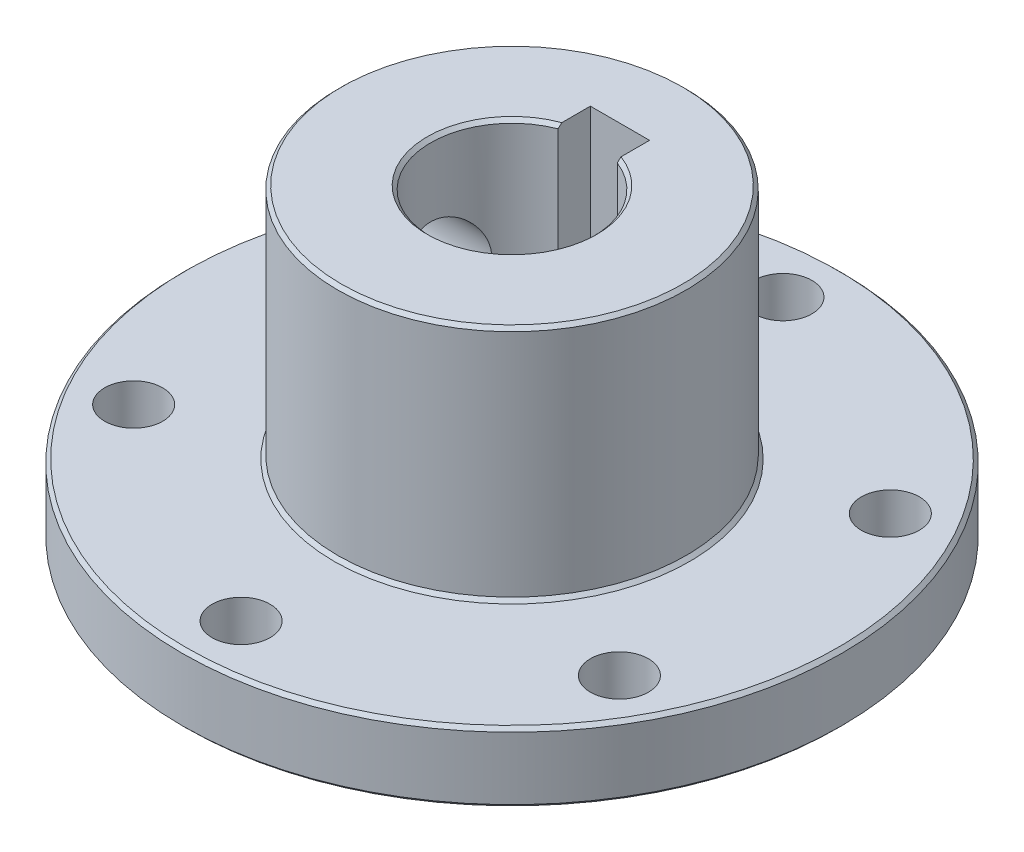
ISO-10303-21;
HEADER;
FILE_DESCRIPTION(('STEP AP214'),'2;1');
FILE_NAME('part.step','',(''),(''),'','','');
FILE_SCHEMA(('AUTOMOTIVE_DESIGN { 1 0 10303 214 1 1 1 1 }'));
ENDSEC;
DATA;
#1=APPLICATION_CONTEXT('core data for automotive mechanical design processes');
#2=APPLICATION_PROTOCOL_DEFINITION('international standard','automotive_design',2000,#1);
#3=PRODUCT_CONTEXT('',#1,'mechanical');
#4=PRODUCT('Part','Part','',(#3));
#5=PRODUCT_RELATED_PRODUCT_CATEGORY('part','',(#4));
#6=PRODUCT_DEFINITION_FORMATION('','',#4);
#7=PRODUCT_DEFINITION_CONTEXT('part definition',#1,'design');
#8=PRODUCT_DEFINITION('design','',#6,#7);
#9=PRODUCT_DEFINITION_SHAPE('','',#8);
#10=(LENGTH_UNIT() NAMED_UNIT(*) SI_UNIT(.MILLI.,.METRE.));
#11=(NAMED_UNIT(*) PLANE_ANGLE_UNIT() SI_UNIT($,.RADIAN.));
#12=(NAMED_UNIT(*) SI_UNIT($,.STERADIAN.) SOLID_ANGLE_UNIT());
#13=UNCERTAINTY_MEASURE_WITH_UNIT(LENGTH_MEASURE(1.E-05),#10,'distance_accuracy_value','');
#14=(GEOMETRIC_REPRESENTATION_CONTEXT(3) GLOBAL_UNCERTAINTY_ASSIGNED_CONTEXT((#13)) GLOBAL_UNIT_ASSIGNED_CONTEXT((#10,
#11,#12)) REPRESENTATION_CONTEXT('',''));
#15=CARTESIAN_POINT('',(0.,0.,0.));
#16=DIRECTION('',(0.,0.,1.));
#17=DIRECTION('',(1.,0.,0.));
#18=AXIS2_PLACEMENT_3D('',#15,#16,#17);
#19=CARTESIAN_POINT('',(0.,26.4,0.));
#20=DIRECTION('',(0.,1.,0.));
#21=DIRECTION('',(0.,0.,1.));
#22=AXIS2_PLACEMENT_3D('',#19,#20,#21);
#23=PLANE('',#22);
#24=CARTESIAN_POINT('',(0.,26.4,0.));
#25=DIRECTION('',(0.,1.,0.));
#26=DIRECTION('',(0.,0.,1.));
#27=AXIS2_PLACEMENT_3D('',#24,#25,#26);
#28=CIRCLE('',#27,14.7);
#29=CARTESIAN_POINT('',(0.,26.4,14.7));
#30=VERTEX_POINT('',#29);
#31=EDGE_CURVE('E244',#30,#30,#28,.T.);
#32=ORIENTED_EDGE('',*,*,#31,.T.);
#33=EDGE_LOOP('',(#32));
#34=FACE_BOUND('',#33,.T.);
#35=DIRECTION('',(0.,0.,-1.));
#36=VECTOR('',#35,1.);
#37=CARTESIAN_POINT('',(2.55,26.4,0.));
#38=LINE('',#37,#36);
#39=CARTESIAN_POINT('',(2.55,26.4,-6.84013888747881));
#40=VERTEX_POINT('',#39);
#41=CARTESIAN_POINT('',(2.55,26.4,-9.3));
#42=VERTEX_POINT('',#41);
#43=EDGE_CURVE('E118',#40,#42,#38,.T.);
#44=ORIENTED_EDGE('',*,*,#43,.F.);
#45=CARTESIAN_POINT('',(0.,26.4,0.));
#46=DIRECTION('',(0.,1.,0.));
#47=DIRECTION('',(0.,0.,1.));
#48=AXIS2_PLACEMENT_3D('',#45,#46,#47);
#49=CIRCLE('',#48,7.29999999999999);
#50=CARTESIAN_POINT('',(-2.55,26.4,-6.84013888747881));
#51=VERTEX_POINT('',#50);
#52=EDGE_CURVE('E60',#40,#51,#49,.F.);
#53=ORIENTED_EDGE('',*,*,#52,.T.);
#54=DIRECTION('',(0.,0.,1.));
#55=VECTOR('',#54,1.);
#56=CARTESIAN_POINT('',(-2.55,26.4,0.));
#57=LINE('',#56,#55);
#58=CARTESIAN_POINT('',(-2.55,26.4,-9.3));
#59=VERTEX_POINT('',#58);
#60=EDGE_CURVE('E131',#59,#51,#57,.T.);
#61=ORIENTED_EDGE('',*,*,#60,.F.);
#62=DIRECTION('',(-1.,0.,0.));
#63=VECTOR('',#62,1.);
#64=CARTESIAN_POINT('',(2.55,26.4,-9.3));
#65=LINE('',#64,#63);
#66=EDGE_CURVE('E136',#42,#59,#65,.T.);
#67=ORIENTED_EDGE('',*,*,#66,.F.);
#68=EDGE_LOOP('',(#44,#53,#61,#67));
#69=FACE_BOUND('',#68,.T.);
#70=ADVANCED_FACE('F43',(#34,#69),#23,.T.);
#71=CARTESIAN_POINT('',(0.,26.4,0.));
#72=DIRECTION('',(0.,-1.,0.));
#73=DIRECTION('',(0.,0.,-1.));
#74=AXIS2_PLACEMENT_3D('',#71,#72,#73);
#75=CYLINDRICAL_SURFACE('',#74,28.4);
#76=CARTESIAN_POINT('',(0.,5.70000000000001,0.));
#77=DIRECTION('',(0.,1.,0.));
#78=DIRECTION('',(0.,0.,1.));
#79=AXIS2_PLACEMENT_3D('',#76,#77,#78);
#80=CIRCLE('',#79,28.4);
#81=CARTESIAN_POINT('',(0.,5.70000000000001,28.4));
#82=VERTEX_POINT('',#81);
#83=EDGE_CURVE('E13',#82,#82,#80,.F.);
#84=ORIENTED_EDGE('',*,*,#83,.T.);
#85=EDGE_LOOP('',(#84));
#86=FACE_BOUND('',#85,.T.);
#87=CARTESIAN_POINT('',(0.,0.299999999999995,0.));
#88=DIRECTION('',(0.,1.,0.));
#89=DIRECTION('',(0.,0.,1.));
#90=AXIS2_PLACEMENT_3D('',#87,#88,#89);
#91=CIRCLE('',#90,28.4);
#92=CARTESIAN_POINT('',(0.,0.299999999999995,28.4));
#93=VERTEX_POINT('',#92);
#94=EDGE_CURVE('E53',#93,#93,#91,.T.);
#95=ORIENTED_EDGE('',*,*,#94,.T.);
#96=EDGE_LOOP('',(#95));
#97=FACE_BOUND('',#96,.T.);
#98=ADVANCED_FACE('F198',(#86,#97),#75,.T.);
#99=CARTESIAN_POINT('',(0.,0.,0.));
#100=DIRECTION('',(0.,1.,0.));
#101=DIRECTION('',(0.,0.,1.));
#102=AXIS2_PLACEMENT_3D('',#99,#100,#101);
#103=PLANE('',#102);
#104=CARTESIAN_POINT('',(0.,0.,0.));
#105=DIRECTION('',(0.,1.,0.));
#106=DIRECTION('',(0.,0.,1.));
#107=AXIS2_PLACEMENT_3D('',#104,#105,#106);
#108=CIRCLE('',#107,28.1);
#109=CARTESIAN_POINT('',(0.,0.,28.1));
#110=VERTEX_POINT('',#109);
#111=EDGE_CURVE('E270',#110,#110,#108,.F.);
#112=ORIENTED_EDGE('',*,*,#111,.T.);
#113=EDGE_LOOP('',(#112));
#114=FACE_BOUND('',#113,.T.);
#115=CARTESIAN_POINT('',(0.409323167053198,0.,23.7464724652929));
#116=DIRECTION('',(0.,-1.,0.));
#117=DIRECTION('',(0.,0.,-1.));
#118=AXIS2_PLACEMENT_3D('',#115,#116,#117);
#119=CIRCLE('',#118,2.5);
#120=CARTESIAN_POINT('',(0.409323167053198,0.,21.2464724652929));
#121=VERTEX_POINT('',#120);
#122=EDGE_CURVE('E321',#121,#121,#119,.T.);
#123=ORIENTED_EDGE('',*,*,#122,.F.);
#124=EDGE_LOOP('',(#123));
#125=FACE_BOUND('',#124,.T.);
#126=CARTESIAN_POINT('',(-20.3603868216841,0.,12.2277204936708));
#127=DIRECTION('',(0.,-1.,0.));
#128=DIRECTION('',(0.,0.,-1.));
#129=AXIS2_PLACEMENT_3D('',#126,#127,#128);
#130=CIRCLE('',#129,2.5);
#131=CARTESIAN_POINT('',(-20.3603868216841,0.,9.72772049367083));
#132=VERTEX_POINT('',#131);
#133=EDGE_CURVE('E327',#132,#132,#130,.T.);
#134=ORIENTED_EDGE('',*,*,#133,.F.);
#135=EDGE_LOOP('',(#134));
#136=FACE_BOUND('',#135,.T.);
#137=CARTESIAN_POINT('',(-20.769709988736,0.,-11.5187519716221));
#138=DIRECTION('',(0.,-1.,0.));
#139=DIRECTION('',(0.,0.,-1.));
#140=AXIS2_PLACEMENT_3D('',#137,#138,#139);
#141=CIRCLE('',#140,2.5);
#142=CARTESIAN_POINT('',(-20.769709988736,0.,-14.0187519716221));
#143=VERTEX_POINT('',#142);
#144=EDGE_CURVE('E322',#143,#143,#141,.T.);
#145=ORIENTED_EDGE('',*,*,#144,.F.);
#146=EDGE_LOOP('',(#145));
#147=FACE_BOUND('',#146,.T.);
#148=CARTESIAN_POINT('',(-0.409323167050521,0.,-23.746472465293));
#149=DIRECTION('',(0.,-1.,0.));
#150=DIRECTION('',(0.,0.,-1.));
#151=AXIS2_PLACEMENT_3D('',#148,#149,#150);
#152=CIRCLE('',#151,2.5);
#153=CARTESIAN_POINT('',(-0.409323167050521,0.,-26.246472465293));
#154=VERTEX_POINT('',#153);
#155=EDGE_CURVE('E326',#154,#154,#152,.T.);
#156=ORIENTED_EDGE('',*,*,#155,.F.);
#157=EDGE_LOOP('',(#156));
#158=FACE_BOUND('',#157,.T.);
#159=CARTESIAN_POINT('',(20.3603868216868,0.,-12.2277204936709));
#160=DIRECTION('',(0.,-1.,0.));
#161=DIRECTION('',(0.,0.,-1.));
#162=AXIS2_PLACEMENT_3D('',#159,#160,#161);
#163=CIRCLE('',#162,2.5);
#164=CARTESIAN_POINT('',(20.3603868216868,0.,-14.7277204936709));
#165=VERTEX_POINT('',#164);
#166=EDGE_CURVE('E331',#165,#165,#163,.T.);
#167=ORIENTED_EDGE('',*,*,#166,.F.);
#168=EDGE_LOOP('',(#167));
#169=FACE_BOUND('',#168,.T.);
#170=CARTESIAN_POINT('',(20.7697099887386,0.,11.518751971622));
#171=DIRECTION('',(0.,-1.,0.));
#172=DIRECTION('',(0.,0.,-1.));
#173=AXIS2_PLACEMENT_3D('',#170,#171,#172);
#174=CIRCLE('',#173,2.5);
#175=CARTESIAN_POINT('',(20.7697099887386,0.,9.01875197162202));
#176=VERTEX_POINT('',#175);
#177=EDGE_CURVE('E335',#176,#176,#174,.T.);
#178=ORIENTED_EDGE('',*,*,#177,.F.);
#179=EDGE_LOOP('',(#178));
#180=FACE_BOUND('',#179,.T.);
#181=DIRECTION('',(0.,0.,1.));
#182=VECTOR('',#181,1.);
#183=CARTESIAN_POINT('',(-2.55,0.,0.));
#184=LINE('',#183,#182);
#185=CARTESIAN_POINT('',(-2.55,0.,-9.3));
#186=VERTEX_POINT('',#185);
#187=CARTESIAN_POINT('',(-2.55,0.,-6.84013888747882));
#188=VERTEX_POINT('',#187);
#189=EDGE_CURVE('E113',#186,#188,#184,.T.);
#190=ORIENTED_EDGE('',*,*,#189,.T.);
#191=CARTESIAN_POINT('',(0.,0.,0.));
#192=DIRECTION('',(0.,1.,0.));
#193=DIRECTION('',(0.,0.,1.));
#194=AXIS2_PLACEMENT_3D('',#191,#192,#193);
#195=CIRCLE('',#194,7.3);
#196=CARTESIAN_POINT('',(2.55,0.,-6.84013888747882));
#197=VERTEX_POINT('',#196);
#198=EDGE_CURVE('E110',#188,#197,#195,.T.);
#199=ORIENTED_EDGE('',*,*,#198,.T.);
#200=DIRECTION('',(0.,0.,-1.));
#201=VECTOR('',#200,1.);
#202=CARTESIAN_POINT('',(2.55,0.,0.));
#203=LINE('',#202,#201);
#204=CARTESIAN_POINT('',(2.55,0.,-9.3));
#205=VERTEX_POINT('',#204);
#206=EDGE_CURVE('E103',#197,#205,#203,.T.);
#207=ORIENTED_EDGE('',*,*,#206,.T.);
#208=DIRECTION('',(-1.,0.,0.));
#209=VECTOR('',#208,1.);
#210=CARTESIAN_POINT('',(2.55,0.,-9.3));
#211=LINE('',#210,#209);
#212=EDGE_CURVE('E108',#205,#186,#211,.T.);
#213=ORIENTED_EDGE('',*,*,#212,.T.);
#214=EDGE_LOOP('',(#190,#199,#207,#213));
#215=FACE_BOUND('',#214,.T.);
#216=ADVANCED_FACE('F106',(#114,#125,#136,#147,#158,#169,#180,#215),#103,.F.);
#217=CARTESIAN_POINT('',(0.,26.4,0.));
#218=DIRECTION('',(0.,-1.,0.));
#219=DIRECTION('',(0.,0.,-1.));
#220=AXIS2_PLACEMENT_3D('',#217,#218,#219);
#221=CYLINDRICAL_SURFACE('',#220,7.);
#222=DIRECTION('',(0.,-1.,0.));
#223=VECTOR('',#222,1.);
#224=CARTESIAN_POINT('',(2.55,26.4,-6.51901066113563));
#225=LINE('',#224,#223);
#226=CARTESIAN_POINT('',(2.55,0.300000000000002,-6.51901066113563));
#227=VERTEX_POINT('',#226);
#228=CARTESIAN_POINT('',(2.55,26.1,-6.51901066113563));
#229=VERTEX_POINT('',#228);
#230=EDGE_CURVE('E293',#227,#229,#225,.F.);
#231=ORIENTED_EDGE('',*,*,#230,.F.);
#232=CARTESIAN_POINT('',(0.,0.300000000000002,0.));
#233=DIRECTION('',(0.,1.,0.));
#234=DIRECTION('',(0.,0.,1.));
#235=AXIS2_PLACEMENT_3D('',#232,#233,#234);
#236=CIRCLE('',#235,7.);
#237=CARTESIAN_POINT('',(-2.55,0.300000000000002,-6.51901066113563));
#238=VERTEX_POINT('',#237);
#239=EDGE_CURVE('E68',#227,#238,#236,.F.);
#240=ORIENTED_EDGE('',*,*,#239,.T.);
#241=DIRECTION('',(0.,-1.,0.));
#242=VECTOR('',#241,1.);
#243=CARTESIAN_POINT('',(-2.55,26.4,-6.51901066113563));
#244=LINE('',#243,#242);
#245=CARTESIAN_POINT('',(-2.55,26.1,-6.51901066113563));
#246=VERTEX_POINT('',#245);
#247=EDGE_CURVE('E290',#246,#238,#244,.T.);
#248=ORIENTED_EDGE('',*,*,#247,.F.);
#249=CARTESIAN_POINT('',(0.,26.1,0.));
#250=DIRECTION('',(0.,1.,0.));
#251=DIRECTION('',(0.,0.,1.));
#252=AXIS2_PLACEMENT_3D('',#249,#250,#251);
#253=CIRCLE('',#252,7.);
#254=EDGE_CURVE('E527',#246,#229,#253,.T.);
#255=ORIENTED_EDGE('',*,*,#254,.T.);
#256=EDGE_LOOP('',(#231,#240,#248,#255));
#257=FACE_BOUND('',#256,.T.);
#258=CARTESIAN_POINT('',(-5.74456264653803,16.2,-4.));
#259=CARTESIAN_POINT('',(-5.74456250545587,16.3017675225536,-4.00000017792025));
#260=CARTESIAN_POINT('',(-5.7472768816087,16.4035373692251,-3.99611042485061));
#261=CARTESIAN_POINT('',(-5.75801696810234,16.6062056611476,-3.98061907020161));
#262=CARTESIAN_POINT('',(-5.76604304274277,16.7071040461491,-3.96901693967328));
#263=CARTESIAN_POINT('',(-5.78708409064427,16.9072873911975,-3.9382742171273));
#264=CARTESIAN_POINT('',(-5.80010250890285,17.0065711876621,-3.91912841930449));
#265=CARTESIAN_POINT('',(-5.83062055670279,17.2027709696905,-3.87357848981441));
#266=CARTESIAN_POINT('',(-5.84812218192167,17.2996858796555,-3.84717112531079));
#267=CARTESIAN_POINT('',(-5.90617198044726,17.5846294998406,-3.75794741305098));
#268=CARTESIAN_POINT('',(-5.95244229157764,17.7683917717442,-3.68488684049058));
#269=CARTESIAN_POINT('',(-6.05484423697808,18.120867444077,-3.51407629259215));
#270=CARTESIAN_POINT('',(-6.11097903049384,18.289575997153,-3.4163184031718));
#271=CARTESIAN_POINT('',(-6.23425561773627,18.6276228989796,-3.18636025123525));
#272=CARTESIAN_POINT('',(-6.30192924373378,18.7949971866189,-3.05155705444501));
#273=CARTESIAN_POINT('',(-6.43642141906034,19.1064187746265,-2.75657710268269));
#274=CARTESIAN_POINT('',(-6.50323938584584,19.2504508878914,-2.59638396124896));
#275=CARTESIAN_POINT('',(-6.60126746318317,19.452787906381,-2.33095355934187));
#276=CARTESIAN_POINT('',(-6.63492350456753,19.5204194017494,-2.23359579523793));
#277=CARTESIAN_POINT('',(-6.69924089530022,19.6471459091598,-2.03255701186538));
#278=CARTESIAN_POINT('',(-6.72990347213864,19.7062444250089,-1.92887861298698));
#279=CARTESIAN_POINT('',(-6.78734754715991,19.815277541692,-1.71583329400292));
#280=CARTESIAN_POINT('',(-6.81413053970133,19.8652156729555,-1.60646858635657));
#281=CARTESIAN_POINT('',(-6.86301836790378,19.9553235419714,-1.38277843619592));
#282=CARTESIAN_POINT('',(-6.88512388595924,19.9954947047495,-1.26845372023141));
#283=CARTESIAN_POINT('',(-6.92223249632158,20.0623834069204,-1.04606947200347));
#284=CARTESIAN_POINT('',(-6.93769052466444,20.0899759816724,-0.938348737869458));
#285=CARTESIAN_POINT('',(-6.96369402042387,20.1361656136436,-0.720418193066241));
#286=CARTESIAN_POINT('',(-6.97424014244627,20.154763869541,-0.610208716123545));
#287=CARTESIAN_POINT('',(-6.99010528336901,20.1826754631434,-0.388318624379013));
#288=CARTESIAN_POINT('',(-6.99542772006381,20.1919948719441,-0.27663902001088));
#289=CARTESIAN_POINT('',(-7.00069636051492,20.2012203308954,-0.0527706357266072));
#290=CARTESIAN_POINT('',(-7.00064303862238,20.2011272115973,0.059418098390922));
#291=CARTESIAN_POINT('',(-6.99547270441839,20.1920734116131,0.270588992729401));
#292=CARTESIAN_POINT('',(-6.99092918439792,20.1841170303487,0.36962948571655));
#293=CARTESIAN_POINT('',(-6.9777323170488,20.1609131230197,0.566584096830259));
#294=CARTESIAN_POINT('',(-6.96907770888135,20.1456633601216,0.664497859955336));
#295=CARTESIAN_POINT('',(-6.93722044931018,20.0892215452166,0.955447946680944));
#296=CARTESIAN_POINT('',(-6.90811897598486,20.0373280798742,1.14589037489433));
#297=CARTESIAN_POINT('',(-6.83641752053745,19.9066949387277,1.51638709607226));
#298=CARTESIAN_POINT('',(-6.79369994957736,19.8277209269349,1.69633410728861));
#299=CARTESIAN_POINT('',(-6.69830567756088,19.6457658963668,2.04074820005986));
#300=CARTESIAN_POINT('',(-6.64562604078221,19.5427777987879,2.20521069702783));
#301=CARTESIAN_POINT('',(-6.52789047479463,19.3025045542265,2.53386204816625));
#302=CARTESIAN_POINT('',(-6.4621086702537,19.1626584118472,2.69591831444933));
#303=CARTESIAN_POINT('',(-6.32878303653683,18.8593439692112,2.99557441346805));
#304=CARTESIAN_POINT('',(-6.26123715550483,18.6958470566786,3.13314416666622));
#305=CARTESIAN_POINT('',(-6.12423546303104,18.330185043018,3.39374323072975));
#306=CARTESIAN_POINT('',(-6.05525992205908,18.1257902770419,3.51395802446782));
#307=CARTESIAN_POINT('',(-5.96320410606823,17.8032492895663,3.66657174031791));
#308=CARTESIAN_POINT('',(-5.93442503661623,17.6931028360619,3.71281794554));
#309=CARTESIAN_POINT('',(-5.88184151841211,17.4680844605832,3.79556701484217));
#310=CARTESIAN_POINT('',(-5.85803533105962,17.3532142069935,3.8320732854033));
#311=CARTESIAN_POINT('',(-5.80533681299947,17.0562669619511,3.91171237868206));
#312=CARTESIAN_POINT('',(-5.78065648689546,16.8714403933237,3.94775185206161));
#313=CARTESIAN_POINT('',(-5.74922925693539,16.4972006027946,3.99339004750995));
#314=CARTESIAN_POINT('',(-5.74246515932664,16.3077919545304,4.00301412009456));
#315=CARTESIAN_POINT('',(-5.7478096662212,15.9296793393323,3.99533473613592));
#316=CARTESIAN_POINT('',(-5.75992943014501,15.7409758551837,3.97801535736587));
#317=CARTESIAN_POINT('',(-5.80131440447044,15.3696990669672,3.91740362631824));
#318=CARTESIAN_POINT('',(-5.8305921056245,15.1871303313983,3.87409235173031));
#319=CARTESIAN_POINT('',(-5.90301826270413,14.8300941964484,3.76281718778972));
#320=CARTESIAN_POINT('',(-5.94633583391191,14.6557568847333,3.69455136011587));
#321=CARTESIAN_POINT('',(-6.04212883183864,14.3203148076395,3.53571246453579));
#322=CARTESIAN_POINT('',(-6.09460799179689,14.1592154760912,3.44513029677264));
#323=CARTESIAN_POINT('',(-6.21332590526351,13.8265104239649,3.2268351681465));
#324=CARTESIAN_POINT('',(-6.28040170680803,13.6576107628442,3.09545280086553));
#325=CARTESIAN_POINT('',(-6.41438594927416,13.3426083476835,2.80728946913642));
#326=CARTESIAN_POINT('',(-6.48129420482183,13.1965246526331,2.65048749122816));
#327=CARTESIAN_POINT('',(-6.58017094111007,12.9902094711598,2.38980955794405));
#328=CARTESIAN_POINT('',(-6.61432852399849,12.9208991489772,2.29381649227938));
#329=CARTESIAN_POINT('',(-6.67983478238711,12.7906946124777,2.09540006644167));
#330=CARTESIAN_POINT('',(-6.71118465652419,12.7297968007011,1.99297948230204));
#331=CARTESIAN_POINT('',(-6.77018725880405,12.617020320381,1.78228359210891));
#332=CARTESIAN_POINT('',(-6.79784037702139,12.5651407000815,1.674008905465));
#333=CARTESIAN_POINT('',(-6.84861328093426,12.4710493188637,1.45237919836931));
#334=CARTESIAN_POINT('',(-6.87173588779857,12.428831538706,1.33902739384187));
#335=CARTESIAN_POINT('',(-6.91107262137708,12.3576399170765,1.11744959385316));
#336=CARTESIAN_POINT('',(-6.92769446294717,12.3278706407735,1.00955142062729));
#337=CARTESIAN_POINT('',(-6.95602801697983,12.2774035848026,0.791073501078646));
#338=CARTESIAN_POINT('',(-6.96774236917105,12.2567009279457,0.680495230325553));
#339=CARTESIAN_POINT('',(-6.98592036480936,12.2246689077901,0.4576156298513));
#340=CARTESIAN_POINT('',(-6.99238659053146,12.2133349346969,0.345315175258243));
#341=CARTESIAN_POINT('',(-6.999879105561,12.2002078213272,0.119981172032726));
#342=CARTESIAN_POINT('',(-7.00090592452407,12.198413752114,0.00694769585055452));
#343=CARTESIAN_POINT('',(-6.99769088625791,12.2040420381066,-0.205591059210677));
#344=CARTESIAN_POINT('',(-6.9940500424018,12.210413019659,-0.305135322655306));
#345=CARTESIAN_POINT('',(-6.98259086738289,12.2305360871047,-0.5032636381619));
#346=CARTESIAN_POINT('',(-6.97477122943116,12.2442904819389,-0.601847380025347));
#347=CARTESIAN_POINT('',(-6.95513892171739,12.2790099035664,-0.797296353688942));
#348=CARTESIAN_POINT('',(-6.94332769226017,12.2999723294993,-0.894162192117851));
#349=CARTESIAN_POINT('',(-6.91598531946425,12.3488627804727,-1.08559609101996));
#350=CARTESIAN_POINT('',(-6.90045273987952,12.3767934950795,-1.18016324876334));
#351=CARTESIAN_POINT('',(-6.84871646764508,12.4706982344634,-1.45976685703936));
#352=CARTESIAN_POINT('',(-6.80738678400023,12.5467633518053,-1.64058646034909));
#353=CARTESIAN_POINT('',(-6.71446322287619,12.72298927559,-1.98702604128474));
#354=CARTESIAN_POINT('',(-6.66286653695899,12.8231566765486,-2.15264184190507));
#355=CARTESIAN_POINT('',(-6.54717784020934,13.0572275879979,-2.4836338303549));
#356=CARTESIAN_POINT('',(-6.48233579401827,13.1936287161548,-2.64698386905321));
#357=CARTESIAN_POINT('',(-6.35028671705981,13.4900612389501,-2.94978302276014));
#358=CARTESIAN_POINT('',(-6.28307693949415,13.6501208165826,-3.08920319736281));
#359=CARTESIAN_POINT('',(-6.14565950765112,14.0092287587649,-3.35492012622472));
#360=CARTESIAN_POINT('',(-6.07587376818233,14.2106041824986,-3.47831821792643));
#361=CARTESIAN_POINT('',(-5.95039255855266,14.6353723817958,-3.68889308968536));
#362=CARTESIAN_POINT('',(-5.89467407425522,14.8587283538227,-3.77612918315148));
#363=CARTESIAN_POINT('',(-5.81695795891842,15.2685810823186,-3.89446299531894));
#364=CARTESIAN_POINT('',(-5.79015222232913,15.4517414164011,-3.93385738898721));
#365=CARTESIAN_POINT('',(-5.76298155052645,15.7303505964879,-3.97344482237813));
#366=CARTESIAN_POINT('',(-5.75609762566707,15.8238711738469,-3.98338995277653));
#367=CARTESIAN_POINT('',(-5.74688892504079,16.0115939794563,-3.99666646398732));
#368=CARTESIAN_POINT('',(-5.74456277713475,16.1057959939823,-3.99999983530306));
#369=CARTESIAN_POINT('',(-5.74456264653803,16.2,-4.));
#370=B_SPLINE_CURVE_WITH_KNOTS('',3,(#258,#259,#260,#261,#262,#263,#264,#265,#266,#267,#268,
#269,#270,#271,#272,#273,#274,#275,#276,#277,#278,#279,#280,#281,#282,#283,#284,#285,#286,#287,
#288,#289,#290,#291,#292,#293,#294,#295,#296,#297,#298,#299,#300,#301,#302,#303,#304,#305,#306,
#307,#308,#309,#310,#311,#312,#313,#314,#315,#316,#317,#318,#319,#320,#321,#322,#323,#324,#325,
#326,#327,#328,#329,#330,#331,#332,#333,#334,#335,#336,#337,#338,#339,#340,#341,#342,#343,#344,
#345,#346,#347,#348,#349,#350,#351,#352,#353,#354,#355,#356,#357,#358,#359,#360,#361,#362,#363,
#364,#365,#366,#367,#368,#369),.UNSPECIFIED.,.T.,.F.,(4,2,2,2,2,2,2,2,2,2,2,2,2,2,2,2,2,2,2,2,2,
2,2,2,2,2,2,2,2,2,2,2,2,2,2,2,2,2,2,2,2,2,2,2,2,2,2,2,2,2,2,2,2,2,2,4),(0.,0.305197063051331,
0.610415060027548,0.915844054665695,1.22140924650362,1.82790796604458,2.43460128091262,
3.1078971199053,3.78162928133011,4.15089858438409,4.520015824422,4.88899050570488,
5.25791132028472,5.59423956661072,5.93052297790606,6.26658621603624,6.60261980033367,
6.90064091359103,7.19875348667916,7.7943934357571,8.39532344113384,8.99643081138254,
9.66548971270188,10.3353649058334,11.0719848204853,11.4401367917138,11.8081598348095,
12.3752119288645,12.9417196398241,13.508562255586,14.0758180388164,14.6501777091916,
15.2247719729936,15.8948940295698,16.5655729031095,16.9348482311232,17.3039651530398,
17.6730430956551,18.0418904762984,18.380880410126,18.7196877670976,19.0583283169085,
19.3969358914005,19.6960183338639,19.9951943599125,20.294262547922,20.5934463470389,
21.192174321383,21.7910662976042,22.4557684337384,23.1212688711274,23.8563890627725,
24.590298683068,25.1554256779336,25.4380251235464,25.7205394782525),.UNSPECIFIED.);
#371=CARTESIAN_POINT('',(-5.74456264653803,16.2,-4.));
#372=VERTEX_POINT('',#371);
#373=EDGE_CURVE('E150',#372,#372,#370,.T.);
#374=ORIENTED_EDGE('',*,*,#373,.F.);
#375=EDGE_LOOP('',(#374));
#376=FACE_BOUND('',#375,.T.);
#377=ADVANCED_FACE('F189',(#257,#376),#221,.F.);
#378=CARTESIAN_POINT('',(0.,6.,0.));
#379=DIRECTION('',(0.,1.,0.));
#380=DIRECTION('',(0.,0.,1.));
#381=AXIS2_PLACEMENT_3D('',#378,#379,#380);
#382=PLANE('',#381);
#383=CARTESIAN_POINT('',(0.,6.,0.));
#384=DIRECTION('',(0.,1.,0.));
#385=DIRECTION('',(0.,0.,1.));
#386=AXIS2_PLACEMENT_3D('',#383,#384,#385);
#387=CIRCLE('',#386,15.3);
#388=CARTESIAN_POINT('',(0.,6.,15.3));
#389=VERTEX_POINT('',#388);
#390=EDGE_CURVE('E282',#389,#389,#387,.F.);
#391=ORIENTED_EDGE('',*,*,#390,.T.);
#392=EDGE_LOOP('',(#391));
#393=FACE_BOUND('',#392,.T.);
#394=CARTESIAN_POINT('',(0.,6.,0.));
#395=DIRECTION('',(0.,1.,0.));
#396=DIRECTION('',(0.,0.,1.));
#397=AXIS2_PLACEMENT_3D('',#394,#395,#396);
#398=CIRCLE('',#397,28.1);
#399=CARTESIAN_POINT('',(0.,6.,28.1));
#400=VERTEX_POINT('',#399);
#401=EDGE_CURVE('E286',#400,#400,#398,.T.);
#402=ORIENTED_EDGE('',*,*,#401,.T.);
#403=EDGE_LOOP('',(#402));
#404=FACE_BOUND('',#403,.T.);
#405=CARTESIAN_POINT('',(0.409323167053198,6.,23.7464724652929));
#406=DIRECTION('',(0.,1.,0.));
#407=DIRECTION('',(0.,0.,1.));
#408=AXIS2_PLACEMENT_3D('',#405,#406,#407);
#409=CIRCLE('',#408,2.5);
#410=CARTESIAN_POINT('',(0.409323167053198,6.,26.2464724652929));
#411=VERTEX_POINT('',#410);
#412=EDGE_CURVE('E297',#411,#411,#409,.T.);
#413=ORIENTED_EDGE('',*,*,#412,.F.);
#414=EDGE_LOOP('',(#413));
#415=FACE_BOUND('',#414,.T.);
#416=CARTESIAN_POINT('',(-20.3603868216841,6.,12.2277204936708));
#417=DIRECTION('',(0.,1.,0.));
#418=DIRECTION('',(0.,0.,1.));
#419=AXIS2_PLACEMENT_3D('',#416,#417,#418);
#420=CIRCLE('',#419,2.5);
#421=CARTESIAN_POINT('',(-20.3603868216841,6.,14.7277204936708));
#422=VERTEX_POINT('',#421);
#423=EDGE_CURVE('E301',#422,#422,#420,.T.);
#424=ORIENTED_EDGE('',*,*,#423,.F.);
#425=EDGE_LOOP('',(#424));
#426=FACE_BOUND('',#425,.T.);
#427=CARTESIAN_POINT('',(-20.769709988736,6.,-11.5187519716221));
#428=DIRECTION('',(0.,1.,0.));
#429=DIRECTION('',(0.,0.,1.));
#430=AXIS2_PLACEMENT_3D('',#427,#428,#429);
#431=CIRCLE('',#430,2.5);
#432=CARTESIAN_POINT('',(-20.769709988736,6.,-9.0187519716221));
#433=VERTEX_POINT('',#432);
#434=EDGE_CURVE('E305',#433,#433,#431,.T.);
#435=ORIENTED_EDGE('',*,*,#434,.F.);
#436=EDGE_LOOP('',(#435));
#437=FACE_BOUND('',#436,.T.);
#438=CARTESIAN_POINT('',(-0.409323167050521,6.,-23.746472465293));
#439=DIRECTION('',(0.,1.,0.));
#440=DIRECTION('',(0.,0.,1.));
#441=AXIS2_PLACEMENT_3D('',#438,#439,#440);
#442=CIRCLE('',#441,2.5);
#443=CARTESIAN_POINT('',(-0.409323167050521,6.,-21.246472465293));
#444=VERTEX_POINT('',#443);
#445=EDGE_CURVE('E309',#444,#444,#442,.T.);
#446=ORIENTED_EDGE('',*,*,#445,.F.);
#447=EDGE_LOOP('',(#446));
#448=FACE_BOUND('',#447,.T.);
#449=CARTESIAN_POINT('',(20.3603868216868,6.,-12.2277204936709));
#450=DIRECTION('',(0.,1.,0.));
#451=DIRECTION('',(0.,0.,1.));
#452=AXIS2_PLACEMENT_3D('',#449,#450,#451);
#453=CIRCLE('',#452,2.5);
#454=CARTESIAN_POINT('',(20.3603868216868,6.,-9.72772049367091));
#455=VERTEX_POINT('',#454);
#456=EDGE_CURVE('E313',#455,#455,#453,.T.);
#457=ORIENTED_EDGE('',*,*,#456,.F.);
#458=EDGE_LOOP('',(#457));
#459=FACE_BOUND('',#458,.T.);
#460=CARTESIAN_POINT('',(20.7697099887386,6.,11.518751971622));
#461=DIRECTION('',(0.,1.,0.));
#462=DIRECTION('',(0.,0.,1.));
#463=AXIS2_PLACEMENT_3D('',#460,#461,#462);
#464=CIRCLE('',#463,2.5);
#465=CARTESIAN_POINT('',(20.7697099887386,6.,14.018751971622));
#466=VERTEX_POINT('',#465);
#467=EDGE_CURVE('E317',#466,#466,#464,.T.);
#468=ORIENTED_EDGE('',*,*,#467,.F.);
#469=EDGE_LOOP('',(#468));
#470=FACE_BOUND('',#469,.T.);
#471=ADVANCED_FACE('F186',(#393,#404,#415,#426,#437,#448,#459,#470),#382,.T.);
#472=CARTESIAN_POINT('',(0.,-82.4470154347335,0.));
#473=DIRECTION('',(0.,1.,0.));
#474=DIRECTION('',(0.,0.,1.));
#475=AXIS2_PLACEMENT_3D('',#472,#473,#474);
#476=CYLINDRICAL_SURFACE('',#475,15.);
#477=CARTESIAN_POINT('',(0.,6.29999999999997,0.));
#478=DIRECTION('',(0.,1.,0.));
#479=DIRECTION('',(0.,0.,1.));
#480=AXIS2_PLACEMENT_3D('',#477,#478,#479);
#481=CIRCLE('',#480,15.);
#482=CARTESIAN_POINT('',(0.,6.29999999999997,15.));
#483=VERTEX_POINT('',#482);
#484=EDGE_CURVE('E274',#483,#483,#481,.T.);
#485=ORIENTED_EDGE('',*,*,#484,.T.);
#486=EDGE_LOOP('',(#485));
#487=FACE_BOUND('',#486,.T.);
#488=CARTESIAN_POINT('',(0.,26.1,0.));
#489=DIRECTION('',(0.,1.,0.));
#490=DIRECTION('',(0.,0.,1.));
#491=AXIS2_PLACEMENT_3D('',#488,#489,#490);
#492=CIRCLE('',#491,15.);
#493=CARTESIAN_POINT('',(0.,26.1,15.));
#494=VERTEX_POINT('',#493);
#495=EDGE_CURVE('E278',#494,#494,#492,.F.);
#496=ORIENTED_EDGE('',*,*,#495,.T.);
#497=EDGE_LOOP('',(#496));
#498=FACE_BOUND('',#497,.T.);
#499=CARTESIAN_POINT('',(-14.456832294801,16.2,-4.));
#500=CARTESIAN_POINT('',(-14.456836113945,16.4203518754806,-3.99999468631742));
#501=CARTESIAN_POINT('',(-14.4619252909935,16.640760000952,-3.98172986449485));
#502=CARTESIAN_POINT('',(-14.4816712231019,17.0752108431127,-3.90929166520474));
#503=CARTESIAN_POINT('',(-14.4963327781587,17.2892503099561,-3.85510027241905));
#504=CARTESIAN_POINT('',(-14.5334475035368,17.7046161398936,-3.71271691120147));
#505=CARTESIAN_POINT('',(-14.5558897136841,17.9059599176569,-3.62457275084355));
#506=CARTESIAN_POINT('',(-14.606023098408,18.2910334801197,-3.41693569127407));
#507=CARTESIAN_POINT('',(-14.6337146806885,18.474761895014,-3.29744035682899));
#508=CARTESIAN_POINT('',(-14.6920027910693,18.8239850939754,-3.02729695749119));
#509=CARTESIAN_POINT('',(-14.7226508223289,18.9889740349289,-2.87600595008417));
#510=CARTESIAN_POINT('',(-14.7829540287301,19.2915631539024,-2.54794854568042));
#511=CARTESIAN_POINT('',(-14.8126091006688,19.4291604922836,-2.37117951069329));
#512=CARTESIAN_POINT('',(-14.8681597693684,19.6751698768059,-1.99367634174654));
#513=CARTESIAN_POINT('',(-14.8939875252459,19.7830790372657,-1.79260363975896));
#514=CARTESIAN_POINT('',(-14.9383825242367,19.9633692707345,-1.37436608945818));
#515=CARTESIAN_POINT('',(-14.9569509915253,20.0357563345631,-1.1572039617502));
#516=CARTESIAN_POINT('',(-14.9843710715292,20.1413104404715,-0.718231923620178));
#517=CARTESIAN_POINT('',(-14.9934355350053,20.1753379532518,-0.496642448401831));
#518=CARTESIAN_POINT('',(-15.001570492355,20.2059142402144,-0.0507271070171473));
#519=CARTESIAN_POINT('',(-15.0006426589323,20.2024692872603,0.173598294877067));
#520=CARTESIAN_POINT('',(-14.9890535171952,20.1588043749211,0.61262847422269));
#521=CARTESIAN_POINT('',(-14.9786382805395,20.1195140847275,0.827433201442203));
#522=CARTESIAN_POINT('',(-14.9495349718099,20.0067757244361,1.24728263114213));
#523=CARTESIAN_POINT('',(-14.9308464280136,19.9333257066278,1.45232677636123));
#524=CARTESIAN_POINT('',(-14.886931381996,19.7536403048154,1.84920789029503));
#525=CARTESIAN_POINT('',(-14.8616417575466,19.6470863857991,2.0408933726588));
#526=CARTESIAN_POINT('',(-14.8072493701969,19.4044623609813,2.4039799975293));
#527=CARTESIAN_POINT('',(-14.7781458644853,19.2683865019416,2.57537717617274));
#528=CARTESIAN_POINT('',(-14.7182254587483,18.9656462841343,2.89857073893016));
#529=CARTESIAN_POINT('',(-14.6873833872759,18.7981711099093,3.04960384035148));
#530=CARTESIAN_POINT('',(-14.6282681005693,18.4399506475144,3.32162664209938));
#531=CARTESIAN_POINT('',(-14.5999950420307,18.2492039415693,3.44261451061104));
#532=CARTESIAN_POINT('',(-14.549118045243,17.8481997963807,3.651693583714));
#533=CARTESIAN_POINT('',(-14.5265501404503,17.6378292982719,3.73957733196031));
#534=CARTESIAN_POINT('',(-14.4900865003605,17.2045470011923,3.87848003366225));
#535=CARTESIAN_POINT('',(-14.4761886145698,16.9816383271305,3.92950812921311));
#536=CARTESIAN_POINT('',(-14.459096712616,16.5367455779215,3.99193514186922));
#537=CARTESIAN_POINT('',(-14.4555952643646,16.3149329027515,4.00447265242678));
#538=CARTESIAN_POINT('',(-14.4588515677209,15.8723804543887,3.99269962245616));
#539=CARTESIAN_POINT('',(-14.4656082275034,15.6516405695216,3.96839300344559));
#540=CARTESIAN_POINT('',(-14.4883224864022,15.2218868118154,3.88462543740026));
#541=CARTESIAN_POINT('',(-14.5041007939926,15.0127291241251,3.82584895825866));
#542=CARTESIAN_POINT('',(-14.542905379049,14.6072407372805,3.67557973450925));
#543=CARTESIAN_POINT('',(-14.5659326029695,14.4109117171453,3.58408271753295));
#544=CARTESIAN_POINT('',(-14.6172714494615,14.0318900851295,3.36865811017419));
#545=CARTESIAN_POINT('',(-14.6456880974578,13.8495920482205,3.2440619047585));
#546=CARTESIAN_POINT('',(-14.7043568386728,13.5080733965937,2.96680455975027));
#547=CARTESIAN_POINT('',(-14.7346092762046,13.3488571300917,2.81413814445932));
#548=CARTESIAN_POINT('',(-14.7945992976893,13.0532950535002,2.47980756500969));
#549=CARTESIAN_POINT('',(-14.824296730477,12.9177432460428,2.29743283201769));
#550=CARTESIAN_POINT('',(-14.8789334003425,12.679178025179,1.91185687188148));
#551=CARTESIAN_POINT('',(-14.9038728906581,12.5761628798422,1.70865675403776));
#552=CARTESIAN_POINT('',(-14.9460230179852,12.406540735277,1.28862826965174));
#553=CARTESIAN_POINT('',(-14.9632911696077,12.3396619611131,1.07191570576467));
#554=CARTESIAN_POINT('',(-14.9884060757449,12.2434225438713,0.629798769462636));
#555=CARTESIAN_POINT('',(-14.9962549180996,12.2140535864506,0.404396334640483));
#556=CARTESIAN_POINT('',(-15.0015482687538,12.1941883525171,-0.0412840026923015));
#557=CARTESIAN_POINT('',(-14.9993045257616,12.2025273617377,-0.26150702305573));
#558=CARTESIAN_POINT('',(-14.9853698195772,12.2551369871504,-0.697296609261437));
#559=CARTESIAN_POINT('',(-14.9736792110957,12.2994062542341,-0.912863349625631));
#560=CARTESIAN_POINT('',(-14.9422262078185,12.4219612098372,-1.33182024692842));
#561=CARTESIAN_POINT('',(-14.9225199437846,12.5000105869449,-1.53528402370308));
#562=CARTESIAN_POINT('',(-14.8770963303299,12.6876992034925,-1.92634419694271));
#563=CARTESIAN_POINT('',(-14.8513781379851,12.7973428732256,-2.1139383633243));
#564=CARTESIAN_POINT('',(-14.7958266244824,13.0485165442741,-2.47335653734734));
#565=CARTESIAN_POINT('',(-14.7659018674327,13.1908187613973,-2.64462672346663));
#566=CARTESIAN_POINT('',(-14.7056800015451,13.5018054987298,-2.96125074312266));
#567=CARTESIAN_POINT('',(-14.6753827967944,13.6704969516387,-3.10659774486097));
#568=CARTESIAN_POINT('',(-14.6170791927771,14.0339367916352,-3.37041400465123));
#569=CARTESIAN_POINT('',(-14.5891378244929,14.2291766273144,-3.48822188522467));
#570=CARTESIAN_POINT('',(-14.5396278780694,14.6374126217205,-3.68917378060109));
#571=CARTESIAN_POINT('',(-14.5180551344989,14.850397057079,-3.77234046734664));
#572=CARTESIAN_POINT('',(-14.4867200130775,15.2521626721025,-3.89076248504962));
#573=CARTESIAN_POINT('',(-14.4756028054439,15.4392025291134,-3.93163036798979));
#574=CARTESIAN_POINT('',(-14.4606577042314,15.8174811159879,-3.98624988587759));
#575=CARTESIAN_POINT('',(-14.4568289795203,16.0087193645776,-4.0000046126432));
#576=CARTESIAN_POINT('',(-14.456832294801,16.2,-4.));
#577=B_SPLINE_CURVE_WITH_KNOTS('',3,(#499,#500,#501,#502,#503,#504,#505,#506,#507,#508,#509,
#510,#511,#512,#513,#514,#515,#516,#517,#518,#519,#520,#521,#522,#523,#524,#525,#526,#527,#528,
#529,#530,#531,#532,#533,#534,#535,#536,#537,#538,#539,#540,#541,#542,#543,#544,#545,#546,#547,
#548,#549,#550,#551,#552,#553,#554,#555,#556,#557,#558,#559,#560,#561,#562,#563,#564,#565,#566,
#567,#568,#569,#570,#571,#572,#573,#574,#575,#576),.UNSPECIFIED.,.T.,.F.,(4,2,2,2,2,2,2,2,2,2,2,
2,2,2,2,2,2,2,2,2,2,2,2,2,2,2,2,2,2,2,2,2,2,2,2,2,2,2,4),(0.,0.660352256232049,1.3210358957004,
1.98079262319234,2.6406006131221,3.31531832260422,3.99010594248922,4.67570414741607,
5.36118668608492,6.03096608632961,6.70063336771206,7.35341141601607,8.00622668881391,
8.6655289781114,9.32495986788982,10.0046352460066,10.6843520527916,11.3682603019536,
12.0519988484194,12.7153066848897,13.3785439269193,14.0290370087007,14.6796150573457,
15.3444926994046,16.0094954308787,16.6937181392419,17.3779044202113,18.0568707918772,
18.7356866392293,19.3936810983785,20.0516508523084,20.7050902974225,21.3586214153685,
22.0295770798807,22.7007093076701,23.3866007797608,24.0720426420754,24.6453393534799,
25.2185706858622),.UNSPECIFIED.);
#578=CARTESIAN_POINT('',(-14.456832294801,16.2,-4.));
#579=VERTEX_POINT('',#578);
#580=EDGE_CURVE('E140',#579,#579,#577,.T.);
#581=ORIENTED_EDGE('',*,*,#580,.T.);
#582=EDGE_LOOP('',(#581));
#583=FACE_BOUND('',#582,.T.);
#584=ADVANCED_FACE('F174',(#487,#498,#583),#476,.T.);
#585=CARTESIAN_POINT('',(20.7697099887386,26.4,11.518751971622));
#586=DIRECTION('',(0.,-1.,0.));
#587=DIRECTION('',(0.,0.,-1.));
#588=AXIS2_PLACEMENT_3D('',#585,#586,#587);
#589=CYLINDRICAL_SURFACE('',#588,2.5);
#590=ORIENTED_EDGE('',*,*,#467,.T.);
#591=EDGE_LOOP('',(#590));
#592=FACE_BOUND('',#591,.T.);
#593=ORIENTED_EDGE('',*,*,#177,.T.);
#594=EDGE_LOOP('',(#593));
#595=FACE_BOUND('',#594,.T.);
#596=ADVANCED_FACE('F170',(#592,#595),#589,.F.);
#597=CARTESIAN_POINT('',(20.3603868216868,26.4,-12.2277204936709));
#598=DIRECTION('',(0.,-1.,0.));
#599=DIRECTION('',(0.,0.,-1.));
#600=AXIS2_PLACEMENT_3D('',#597,#598,#599);
#601=CYLINDRICAL_SURFACE('',#600,2.5);
#602=ORIENTED_EDGE('',*,*,#456,.T.);
#603=EDGE_LOOP('',(#602));
#604=FACE_BOUND('',#603,.T.);
#605=ORIENTED_EDGE('',*,*,#166,.T.);
#606=EDGE_LOOP('',(#605));
#607=FACE_BOUND('',#606,.T.);
#608=ADVANCED_FACE('F173',(#604,#607),#601,.F.);
#609=CARTESIAN_POINT('',(-0.409323167050521,26.4,-23.746472465293));
#610=DIRECTION('',(0.,-1.,0.));
#611=DIRECTION('',(0.,0.,-1.));
#612=AXIS2_PLACEMENT_3D('',#609,#610,#611);
#613=CYLINDRICAL_SURFACE('',#612,2.5);
#614=ORIENTED_EDGE('',*,*,#445,.T.);
#615=EDGE_LOOP('',(#614));
#616=FACE_BOUND('',#615,.T.);
#617=ORIENTED_EDGE('',*,*,#155,.T.);
#618=EDGE_LOOP('',(#617));
#619=FACE_BOUND('',#618,.T.);
#620=ADVANCED_FACE('F178',(#616,#619),#613,.F.);
#621=CARTESIAN_POINT('',(-20.769709988736,26.4,-11.5187519716221));
#622=DIRECTION('',(0.,-1.,0.));
#623=DIRECTION('',(0.,0.,-1.));
#624=AXIS2_PLACEMENT_3D('',#621,#622,#623);
#625=CYLINDRICAL_SURFACE('',#624,2.5);
#626=ORIENTED_EDGE('',*,*,#434,.T.);
#627=EDGE_LOOP('',(#626));
#628=FACE_BOUND('',#627,.T.);
#629=ORIENTED_EDGE('',*,*,#144,.T.);
#630=EDGE_LOOP('',(#629));
#631=FACE_BOUND('',#630,.T.);
#632=ADVANCED_FACE('F168',(#628,#631),#625,.F.);
#633=CARTESIAN_POINT('',(-20.3603868216841,26.4,12.2277204936708));
#634=DIRECTION('',(0.,-1.,0.));
#635=DIRECTION('',(0.,0.,-1.));
#636=AXIS2_PLACEMENT_3D('',#633,#634,#635);
#637=CYLINDRICAL_SURFACE('',#636,2.5);
#638=ORIENTED_EDGE('',*,*,#423,.T.);
#639=EDGE_LOOP('',(#638));
#640=FACE_BOUND('',#639,.T.);
#641=ORIENTED_EDGE('',*,*,#133,.T.);
#642=EDGE_LOOP('',(#641));
#643=FACE_BOUND('',#642,.T.);
#644=ADVANCED_FACE('F164',(#640,#643),#637,.F.);
#645=CARTESIAN_POINT('',(0.409323167053198,26.4,23.7464724652929));
#646=DIRECTION('',(0.,-1.,0.));
#647=DIRECTION('',(0.,0.,-1.));
#648=AXIS2_PLACEMENT_3D('',#645,#646,#647);
#649=CYLINDRICAL_SURFACE('',#648,2.5);
#650=ORIENTED_EDGE('',*,*,#412,.T.);
#651=EDGE_LOOP('',(#650));
#652=FACE_BOUND('',#651,.T.);
#653=ORIENTED_EDGE('',*,*,#122,.T.);
#654=EDGE_LOOP('',(#653));
#655=FACE_BOUND('',#654,.T.);
#656=ADVANCED_FACE('F161',(#652,#655),#649,.F.);
#657=CARTESIAN_POINT('',(-28.401,16.2,0.));
#658=DIRECTION('',(1.,0.,0.));
#659=DIRECTION('',(0.,0.,-1.));
#660=AXIS2_PLACEMENT_3D('',#657,#658,#659);
#661=CYLINDRICAL_SURFACE('',#660,4.);
#662=ORIENTED_EDGE('',*,*,#373,.T.);
#663=EDGE_LOOP('',(#662));
#664=FACE_BOUND('',#663,.T.);
#665=ORIENTED_EDGE('',*,*,#580,.F.);
#666=EDGE_LOOP('',(#665));
#667=FACE_BOUND('',#666,.T.);
#668=ADVANCED_FACE('F156',(#664,#667),#661,.F.);
#669=CARTESIAN_POINT('',(-2.55,0.,0.));
#670=DIRECTION('',(-1.,0.,0.));
#671=DIRECTION('',(0.,0.,1.));
#672=AXIS2_PLACEMENT_3D('',#669,#670,#671);
#673=PLANE('',#672);
#674=ORIENTED_EDGE('',*,*,#247,.T.);
#675=CARTESIAN_POINT('',(-2.55,0.300000000000002,-6.51901066113563));
#676=CARTESIAN_POINT('',(-2.55,0.25008167261335,-6.57260833248386));
#677=CARTESIAN_POINT('',(-2.55,0.200122508614185,-6.62616785401295));
#678=CARTESIAN_POINT('',(-2.55,0.10012250861219,-6.73321059612548));
#679=CARTESIAN_POINT('',(-2.55,0.050081672611354,-6.78669381671079));
#680=CARTESIAN_POINT('',(-2.55,0.,-6.84013888747882));
#681=B_SPLINE_CURVE_WITH_KNOTS('',3,(#675,#676,#677,#678,#679,#680),.UNSPECIFIED.,.F.,.F.,(4,2,
4),(0.,0.219729068912798,0.439458132458228),.UNSPECIFIED.);
#682=EDGE_CURVE('E236',#238,#188,#681,.T.);
#683=ORIENTED_EDGE('',*,*,#682,.T.);
#684=ORIENTED_EDGE('',*,*,#189,.F.);
#685=DIRECTION('',(0.,1.,0.));
#686=VECTOR('',#685,1.);
#687=CARTESIAN_POINT('',(-2.55,0.,-9.3));
#688=LINE('',#687,#686);
#689=EDGE_CURVE('E123',#186,#59,#688,.T.);
#690=ORIENTED_EDGE('',*,*,#689,.T.);
#691=ORIENTED_EDGE('',*,*,#60,.T.);
#692=CARTESIAN_POINT('',(-2.55,26.4,-6.84013888747881));
#693=CARTESIAN_POINT('',(-2.55,26.3499183273886,-6.78669381671077));
#694=CARTESIAN_POINT('',(-2.55,26.2998774913878,-6.73321059612547));
#695=CARTESIAN_POINT('',(-2.55,26.1998774913858,-6.62616785401294));
#696=CARTESIAN_POINT('',(-2.55,26.1499183273867,-6.57260833248385));
#697=CARTESIAN_POINT('',(-2.55,26.1,-6.51901066113563));
#698=B_SPLINE_CURVE_WITH_KNOTS('',3,(#692,#693,#694,#695,#696,#697),.UNSPECIFIED.,.F.,.F.,(4,2,
4),(0.,0.219729063545423,0.439458132458216),.UNSPECIFIED.);
#699=EDGE_CURVE('E245',#51,#246,#698,.T.);
#700=ORIENTED_EDGE('',*,*,#699,.T.);
#701=EDGE_LOOP('',(#674,#683,#684,#690,#691,#700));
#702=FACE_BOUND('',#701,.T.);
#703=ADVANCED_FACE('F252',(#702),#673,.F.);
#704=CARTESIAN_POINT('',(2.55,0.,-9.3));
#705=DIRECTION('',(0.,0.,-1.));
#706=DIRECTION('',(-1.,0.,0.));
#707=AXIS2_PLACEMENT_3D('',#704,#705,#706);
#708=PLANE('',#707);
#709=ORIENTED_EDGE('',*,*,#66,.T.);
#710=ORIENTED_EDGE('',*,*,#689,.F.);
#711=ORIENTED_EDGE('',*,*,#212,.F.);
#712=DIRECTION('',(0.,1.,0.));
#713=VECTOR('',#712,1.);
#714=CARTESIAN_POINT('',(2.55,0.,-9.3));
#715=LINE('',#714,#713);
#716=EDGE_CURVE('E116',#205,#42,#715,.T.);
#717=ORIENTED_EDGE('',*,*,#716,.T.);
#718=EDGE_LOOP('',(#709,#710,#711,#717));
#719=FACE_BOUND('',#718,.T.);
#720=ADVANCED_FACE('F125',(#719),#708,.F.);
#721=CARTESIAN_POINT('',(2.55,0.,0.));
#722=DIRECTION('',(1.,0.,0.));
#723=DIRECTION('',(0.,0.,-1.));
#724=AXIS2_PLACEMENT_3D('',#721,#722,#723);
#725=PLANE('',#724);
#726=ORIENTED_EDGE('',*,*,#206,.F.);
#727=CARTESIAN_POINT('',(2.55,0.,-6.84013888747882));
#728=CARTESIAN_POINT('',(2.55,0.0500816726113536,-6.78669381671079));
#729=CARTESIAN_POINT('',(2.55,0.100122508612189,-6.73321059612548));
#730=CARTESIAN_POINT('',(2.55,0.200122508614185,-6.62616785401295));
#731=CARTESIAN_POINT('',(2.55,0.25008167261335,-6.57260833248386));
#732=CARTESIAN_POINT('',(2.55,0.300000000000002,-6.51901066113563));
#733=B_SPLINE_CURVE_WITH_KNOTS('',3,(#727,#728,#729,#730,#731,#732),.UNSPECIFIED.,.F.,.F.,(4,2,
4),(0.,0.219729063545431,0.439458132458229),.UNSPECIFIED.);
#734=EDGE_CURVE('E227',#197,#227,#733,.T.);
#735=ORIENTED_EDGE('',*,*,#734,.T.);
#736=ORIENTED_EDGE('',*,*,#230,.T.);
#737=CARTESIAN_POINT('',(2.55,26.1,-6.51901066113563));
#738=CARTESIAN_POINT('',(2.55,26.1499183273867,-6.57260833248385));
#739=CARTESIAN_POINT('',(2.55,26.1998774913858,-6.62616785401294));
#740=CARTESIAN_POINT('',(2.55,26.2998774913878,-6.73321059612547));
#741=CARTESIAN_POINT('',(2.55,26.3499183273887,-6.78669381671078));
#742=CARTESIAN_POINT('',(2.55,26.4,-6.84013888747881));
#743=B_SPLINE_CURVE_WITH_KNOTS('',3,(#737,#738,#739,#740,#741,#742),.UNSPECIFIED.,.F.,.F.,(4,2,
4),(0.,0.219729068912794,0.439458132458219),.UNSPECIFIED.);
#744=EDGE_CURVE('E261',#229,#40,#743,.T.);
#745=ORIENTED_EDGE('',*,*,#744,.T.);
#746=ORIENTED_EDGE('',*,*,#43,.T.);
#747=ORIENTED_EDGE('',*,*,#716,.F.);
#748=EDGE_LOOP('',(#726,#735,#736,#745,#746,#747));
#749=FACE_BOUND('',#748,.T.);
#750=ADVANCED_FACE('F117',(#749),#725,.F.);
#751=CARTESIAN_POINT('',(0.,6.00000000000001,0.));
#752=DIRECTION('',(0.,-1.,0.));
#753=DIRECTION('',(0.,0.,-1.));
#754=AXIS2_PLACEMENT_3D('',#751,#752,#753);
#755=CONICAL_SURFACE('',#754,15.3,0.78539816339746);
#756=ORIENTED_EDGE('',*,*,#484,.F.);
#757=EDGE_LOOP('',(#756));
#758=FACE_BOUND('',#757,.T.);
#759=ORIENTED_EDGE('',*,*,#390,.F.);
#760=EDGE_LOOP('',(#759));
#761=FACE_BOUND('',#760,.T.);
#762=ADVANCED_FACE('F207',(#758,#761),#755,.T.);
#763=CARTESIAN_POINT('',(0.,0.,0.));
#764=DIRECTION('',(0.,-1.,0.));
#765=DIRECTION('',(0.,0.,-1.));
#766=AXIS2_PLACEMENT_3D('',#763,#764,#765);
#767=CONICAL_SURFACE('',#766,7.3,0.785398163397447);
#768=ORIENTED_EDGE('',*,*,#682,.F.);
#769=ORIENTED_EDGE('',*,*,#239,.F.);
#770=ORIENTED_EDGE('',*,*,#734,.F.);
#771=ORIENTED_EDGE('',*,*,#198,.F.);
#772=EDGE_LOOP('',(#768,#769,#770,#771));
#773=FACE_BOUND('',#772,.T.);
#774=ADVANCED_FACE('F213',(#773),#767,.F.);
#775=CARTESIAN_POINT('',(0.,26.1,0.));
#776=DIRECTION('',(0.,1.,0.));
#777=DIRECTION('',(0.,0.,1.));
#778=AXIS2_PLACEMENT_3D('',#775,#776,#777);
#779=CONICAL_SURFACE('',#778,7.,0.78539816339743);
#780=ORIENTED_EDGE('',*,*,#699,.F.);
#781=ORIENTED_EDGE('',*,*,#52,.F.);
#782=ORIENTED_EDGE('',*,*,#744,.F.);
#783=ORIENTED_EDGE('',*,*,#254,.F.);
#784=EDGE_LOOP('',(#780,#781,#782,#783));
#785=FACE_BOUND('',#784,.T.);
#786=ADVANCED_FACE('F221',(#785),#779,.F.);
#787=CARTESIAN_POINT('',(0.,26.4,0.));
#788=DIRECTION('',(0.,-1.,0.));
#789=DIRECTION('',(0.,0.,-1.));
#790=AXIS2_PLACEMENT_3D('',#787,#788,#789);
#791=CONICAL_SURFACE('',#790,14.7,0.785398163397414);
#792=ORIENTED_EDGE('',*,*,#495,.F.);
#793=EDGE_LOOP('',(#792));
#794=FACE_BOUND('',#793,.T.);
#795=ORIENTED_EDGE('',*,*,#31,.F.);
#796=EDGE_LOOP('',(#795));
#797=FACE_BOUND('',#796,.T.);
#798=ADVANCED_FACE('F403',(#794,#797),#791,.T.);
#799=CARTESIAN_POINT('',(0.,6.,0.));
#800=DIRECTION('',(0.,-1.,0.));
#801=DIRECTION('',(0.,0.,-1.));
#802=AXIS2_PLACEMENT_3D('',#799,#800,#801);
#803=CONICAL_SURFACE('',#802,28.1,0.785398163397454);
#804=ORIENTED_EDGE('',*,*,#83,.F.);
#805=EDGE_LOOP('',(#804));
#806=FACE_BOUND('',#805,.T.);
#807=ORIENTED_EDGE('',*,*,#401,.F.);
#808=EDGE_LOOP('',(#807));
#809=FACE_BOUND('',#808,.T.);
#810=ADVANCED_FACE('F410',(#806,#809),#803,.T.);
#811=CARTESIAN_POINT('',(0.,0.299999999999995,0.));
#812=DIRECTION('',(0.,1.,0.));
#813=DIRECTION('',(0.,0.,1.));
#814=AXIS2_PLACEMENT_3D('',#811,#812,#813);
#815=CONICAL_SURFACE('',#814,28.4,0.785398163397443);
#816=ORIENTED_EDGE('',*,*,#111,.F.);
#817=EDGE_LOOP('',(#816));
#818=FACE_BOUND('',#817,.T.);
#819=ORIENTED_EDGE('',*,*,#94,.F.);
#820=EDGE_LOOP('',(#819));
#821=FACE_BOUND('',#820,.T.);
#822=ADVANCED_FACE('F46',(#818,#821),#815,.T.);
#823=CLOSED_SHELL('',(#70,#98,#216,#377,#471,#584,#596,#608,#620,#632,#644,#656,#668,#703,#720,
#750,#762,#774,#786,#798,#810,#822));
#824=MANIFOLD_SOLID_BREP('B2',#823);
#825=ADVANCED_BREP_SHAPE_REPRESENTATION('',(#18,#824),#14);
#826=SHAPE_DEFINITION_REPRESENTATION(#9,#825);
ENDSEC;
END-ISO-10303-21;
